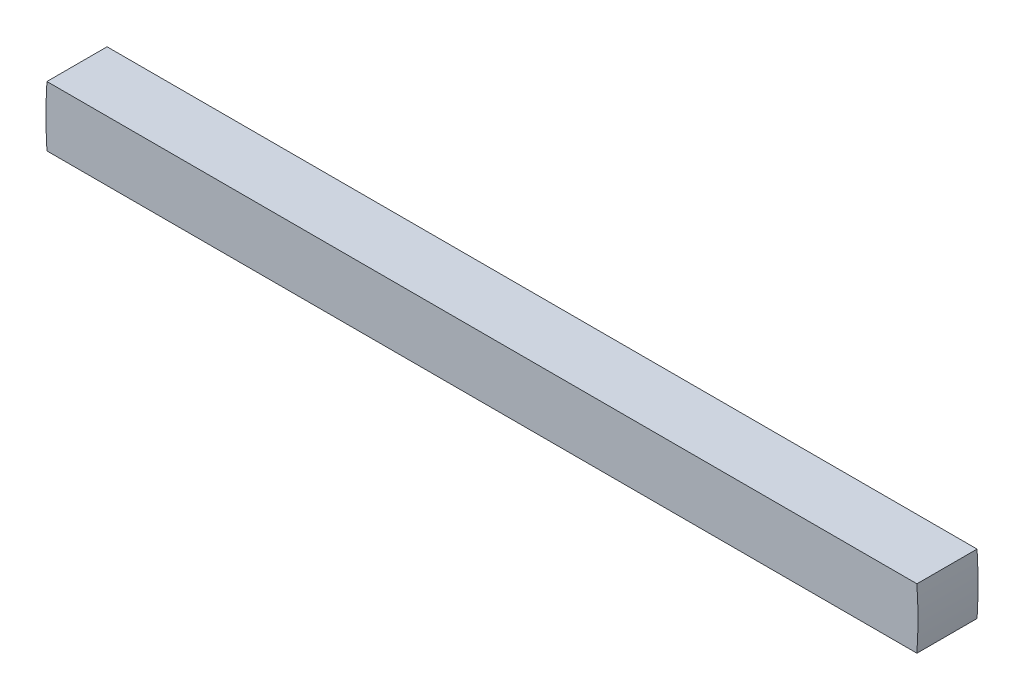
ISO-10303-21;
HEADER;
FILE_DESCRIPTION(('STEP AP214'),'2;1');
FILE_NAME('part.step','',(''),(''),'','','');
FILE_SCHEMA(('AUTOMOTIVE_DESIGN { 1 0 10303 214 1 1 1 1 }'));
ENDSEC;
DATA;
#1=APPLICATION_CONTEXT('core data for automotive mechanical design processes');
#2=APPLICATION_PROTOCOL_DEFINITION('international standard','automotive_design',2000,#1);
#3=PRODUCT_CONTEXT('',#1,'mechanical');
#4=PRODUCT('Part','Part','',(#3));
#5=PRODUCT_RELATED_PRODUCT_CATEGORY('part','',(#4));
#6=PRODUCT_DEFINITION_FORMATION('','',#4);
#7=PRODUCT_DEFINITION_CONTEXT('part definition',#1,'design');
#8=PRODUCT_DEFINITION('design','',#6,#7);
#9=PRODUCT_DEFINITION_SHAPE('','',#8);
#10=(LENGTH_UNIT() NAMED_UNIT(*) SI_UNIT(.MILLI.,.METRE.));
#11=(NAMED_UNIT(*) PLANE_ANGLE_UNIT() SI_UNIT($,.RADIAN.));
#12=(NAMED_UNIT(*) SI_UNIT($,.STERADIAN.) SOLID_ANGLE_UNIT());
#13=UNCERTAINTY_MEASURE_WITH_UNIT(LENGTH_MEASURE(1.E-05),#10,'distance_accuracy_value','');
#14=(GEOMETRIC_REPRESENTATION_CONTEXT(3) GLOBAL_UNCERTAINTY_ASSIGNED_CONTEXT((#13)) GLOBAL_UNIT_ASSIGNED_CONTEXT((#10,
#11,#12)) REPRESENTATION_CONTEXT('',''));
#15=CARTESIAN_POINT('',(0.,0.,0.));
#16=DIRECTION('',(0.,0.,1.));
#17=DIRECTION('',(1.,0.,0.));
#18=AXIS2_PLACEMENT_3D('',#15,#16,#17);
#19=CARTESIAN_POINT('',(0.,0.,5.13588));
#20=DIRECTION('',(0.,0.,-1.));
#21=DIRECTION('',(-1.,0.,0.));
#22=AXIS2_PLACEMENT_3D('',#19,#20,#21);
#23=CYLINDRICAL_SURFACE('',#22,23.01875);
#24=DIRECTION('',(0.,0.,-1.));
#25=VECTOR('',#24,1.);
#26=CARTESIAN_POINT('',(-22.9639433746145,-1.5875,5.13588));
#27=LINE('',#26,#25);
#28=CARTESIAN_POINT('',(-22.9639433746145,-1.5875,3.175));
#29=VERTEX_POINT('',#28);
#30=CARTESIAN_POINT('',(-22.9639433746145,-1.5875,0.));
#31=VERTEX_POINT('',#30);
#32=EDGE_CURVE('E51',#29,#31,#27,.T.);
#33=ORIENTED_EDGE('',*,*,#32,.F.);
#34=CARTESIAN_POINT('',(0.,0.,3.175));
#35=DIRECTION('',(0.,0.,-1.));
#36=DIRECTION('',(-1.,0.,0.));
#37=AXIS2_PLACEMENT_3D('',#34,#35,#36);
#38=CIRCLE('',#37,23.01875);
#39=CARTESIAN_POINT('',(-22.9639433746145,1.5875,3.175));
#40=VERTEX_POINT('',#39);
#41=EDGE_CURVE('E93',#29,#40,#38,.T.);
#42=ORIENTED_EDGE('',*,*,#41,.T.);
#43=DIRECTION('',(0.,0.,-1.));
#44=VECTOR('',#43,1.);
#45=CARTESIAN_POINT('',(-22.9639433746145,1.5875,5.13588));
#46=LINE('',#45,#44);
#47=CARTESIAN_POINT('',(-22.9639433746145,1.5875,0.));
#48=VERTEX_POINT('',#47);
#49=EDGE_CURVE('E58',#40,#48,#46,.T.);
#50=ORIENTED_EDGE('',*,*,#49,.T.);
#51=CARTESIAN_POINT('',(0.,0.,0.));
#52=DIRECTION('',(0.,0.,1.));
#53=DIRECTION('',(-1.,0.,0.));
#54=AXIS2_PLACEMENT_3D('',#51,#52,#53);
#55=CIRCLE('',#54,23.01875);
#56=EDGE_CURVE('E118',#48,#31,#55,.T.);
#57=ORIENTED_EDGE('',*,*,#56,.T.);
#58=EDGE_LOOP('',(#33,#42,#50,#57));
#59=FACE_BOUND('',#58,.T.);
#60=ADVANCED_FACE('F43',(#59),#23,.T.);
#61=CARTESIAN_POINT('',(-22.9639433746145,-1.5875,5.13588));
#62=DIRECTION('',(0.,1.,0.));
#63=DIRECTION('',(0.,0.,1.));
#64=AXIS2_PLACEMENT_3D('',#61,#62,#63);
#65=PLANE('',#64);
#66=DIRECTION('',(0.,0.,-1.));
#67=VECTOR('',#66,1.);
#68=CARTESIAN_POINT('',(22.9639433746145,-1.5875,5.13588));
#69=LINE('',#68,#67);
#70=CARTESIAN_POINT('',(22.9639433746145,-1.5875,3.175));
#71=VERTEX_POINT('',#70);
#72=CARTESIAN_POINT('',(22.9639433746145,-1.5875,0.));
#73=VERTEX_POINT('',#72);
#74=EDGE_CURVE('E100',#71,#73,#69,.T.);
#75=ORIENTED_EDGE('',*,*,#74,.F.);
#76=DIRECTION('',(1.,0.,0.));
#77=VECTOR('',#76,1.);
#78=CARTESIAN_POINT('',(-22.9639433746145,-1.5875,3.175));
#79=LINE('',#78,#77);
#80=EDGE_CURVE('E89',#29,#71,#79,.T.);
#81=ORIENTED_EDGE('',*,*,#80,.F.);
#82=ORIENTED_EDGE('',*,*,#32,.T.);
#83=DIRECTION('',(1.,0.,0.));
#84=VECTOR('',#83,1.);
#85=CARTESIAN_POINT('',(-22.9639433746145,-1.5875,0.));
#86=LINE('',#85,#84);
#87=EDGE_CURVE('E114',#31,#73,#86,.T.);
#88=ORIENTED_EDGE('',*,*,#87,.T.);
#89=EDGE_LOOP('',(#75,#81,#82,#88));
#90=FACE_BOUND('',#89,.T.);
#91=ADVANCED_FACE('F113',(#90),#65,.F.);
#92=CARTESIAN_POINT('',(0.,0.,5.13588));
#93=DIRECTION('',(0.,0.,-1.));
#94=DIRECTION('',(-1.,0.,0.));
#95=AXIS2_PLACEMENT_3D('',#92,#93,#94);
#96=CYLINDRICAL_SURFACE('',#95,23.01875);
#97=DIRECTION('',(0.,0.,-1.));
#98=VECTOR('',#97,1.);
#99=CARTESIAN_POINT('',(22.9639433746145,1.5875,5.13588));
#100=LINE('',#99,#98);
#101=CARTESIAN_POINT('',(22.9639433746145,1.5875,3.175));
#102=VERTEX_POINT('',#101);
#103=CARTESIAN_POINT('',(22.9639433746145,1.5875,0.));
#104=VERTEX_POINT('',#103);
#105=EDGE_CURVE('E65',#102,#104,#100,.T.);
#106=ORIENTED_EDGE('',*,*,#105,.F.);
#107=CARTESIAN_POINT('',(0.,0.,3.175));
#108=DIRECTION('',(0.,0.,-1.));
#109=DIRECTION('',(-1.,0.,0.));
#110=AXIS2_PLACEMENT_3D('',#107,#108,#109);
#111=CIRCLE('',#110,23.01875);
#112=EDGE_CURVE('E87',#102,#71,#111,.T.);
#113=ORIENTED_EDGE('',*,*,#112,.T.);
#114=ORIENTED_EDGE('',*,*,#74,.T.);
#115=CARTESIAN_POINT('',(0.,0.,0.));
#116=DIRECTION('',(0.,0.,1.));
#117=DIRECTION('',(1.,0.,0.));
#118=AXIS2_PLACEMENT_3D('',#115,#116,#117);
#119=CIRCLE('',#118,23.01875);
#120=EDGE_CURVE('E97',#73,#104,#119,.T.);
#121=ORIENTED_EDGE('',*,*,#120,.T.);
#122=EDGE_LOOP('',(#106,#113,#114,#121));
#123=FACE_BOUND('',#122,.T.);
#124=ADVANCED_FACE('F95',(#123),#96,.T.);
#125=CARTESIAN_POINT('',(-22.9639433746145,1.5875,5.13588));
#126=DIRECTION('',(0.,-1.,0.));
#127=DIRECTION('',(0.,0.,-1.));
#128=AXIS2_PLACEMENT_3D('',#125,#126,#127);
#129=PLANE('',#128);
#130=ORIENTED_EDGE('',*,*,#49,.F.);
#131=DIRECTION('',(-1.,0.,0.));
#132=VECTOR('',#131,1.);
#133=CARTESIAN_POINT('',(-22.9639433746145,1.5875,3.175));
#134=LINE('',#133,#132);
#135=EDGE_CURVE('E11',#102,#40,#134,.T.);
#136=ORIENTED_EDGE('',*,*,#135,.F.);
#137=ORIENTED_EDGE('',*,*,#105,.T.);
#138=DIRECTION('',(-1.,0.,0.));
#139=VECTOR('',#138,1.);
#140=CARTESIAN_POINT('',(-22.9639433746145,1.5875,0.));
#141=LINE('',#140,#139);
#142=EDGE_CURVE('E105',#104,#48,#141,.T.);
#143=ORIENTED_EDGE('',*,*,#142,.T.);
#144=EDGE_LOOP('',(#130,#136,#137,#143));
#145=FACE_BOUND('',#144,.T.);
#146=ADVANCED_FACE('F83',(#145),#129,.F.);
#147=CARTESIAN_POINT('',(0.,0.,0.));
#148=DIRECTION('',(0.,0.,-1.));
#149=DIRECTION('',(-1.,0.,0.));
#150=AXIS2_PLACEMENT_3D('',#147,#148,#149);
#151=PLANE('',#150);
#152=ORIENTED_EDGE('',*,*,#56,.F.);
#153=ORIENTED_EDGE('',*,*,#142,.F.);
#154=ORIENTED_EDGE('',*,*,#120,.F.);
#155=ORIENTED_EDGE('',*,*,#87,.F.);
#156=EDGE_LOOP('',(#152,#153,#154,#155));
#157=FACE_BOUND('',#156,.T.);
#158=ADVANCED_FACE('F117',(#157),#151,.T.);
#159=CARTESIAN_POINT('',(0.,0.,3.175));
#160=DIRECTION('',(0.,0.,1.));
#161=DIRECTION('',(1.,0.,0.));
#162=AXIS2_PLACEMENT_3D('',#159,#160,#161);
#163=PLANE('',#162);
#164=ORIENTED_EDGE('',*,*,#80,.T.);
#165=ORIENTED_EDGE('',*,*,#112,.F.);
#166=ORIENTED_EDGE('',*,*,#135,.T.);
#167=ORIENTED_EDGE('',*,*,#41,.F.);
#168=EDGE_LOOP('',(#164,#165,#166,#167));
#169=FACE_BOUND('',#168,.T.);
#170=ADVANCED_FACE('F88',(#169),#163,.T.);
#171=CLOSED_SHELL('',(#60,#91,#124,#146,#158,#170));
#172=MANIFOLD_SOLID_BREP('B2',#171);
#173=ADVANCED_BREP_SHAPE_REPRESENTATION('',(#18,#172),#14);
#174=SHAPE_DEFINITION_REPRESENTATION(#9,#173);
ENDSEC;
END-ISO-10303-21;
